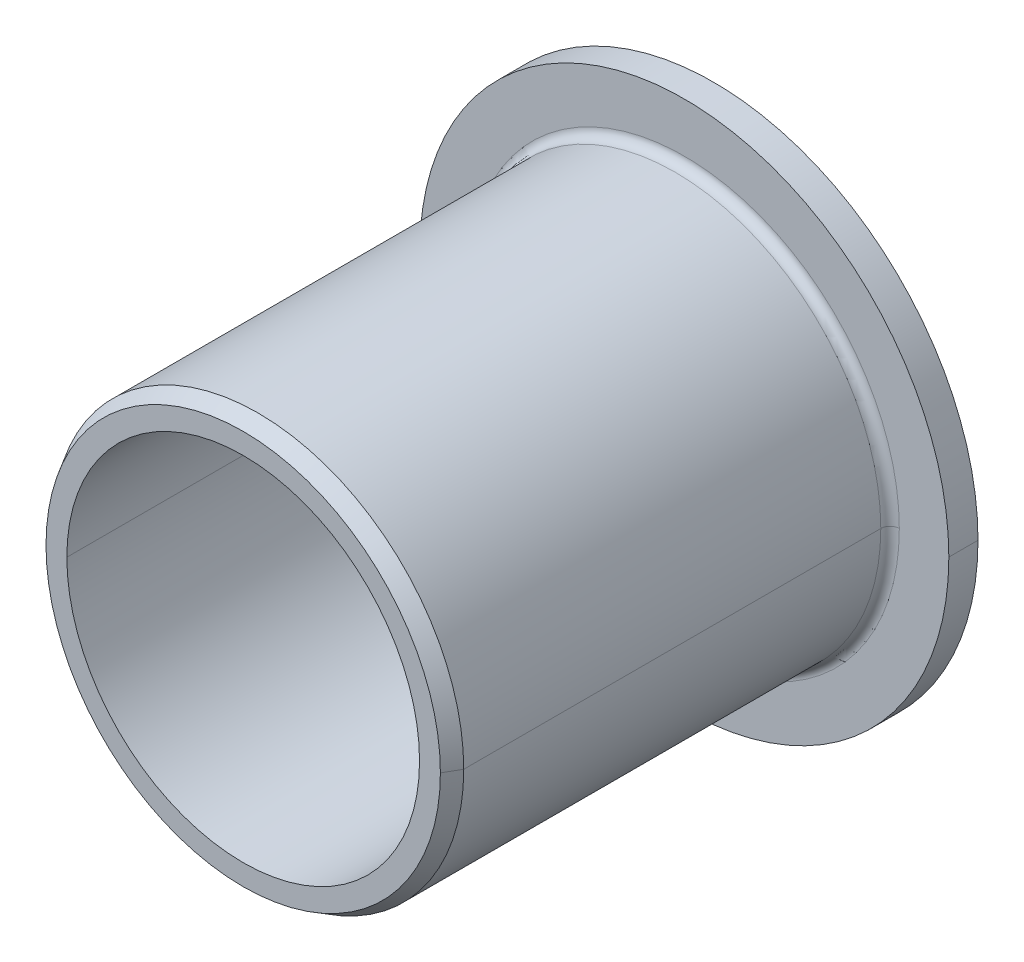
ISO-10303-21;
HEADER;
FILE_DESCRIPTION(('STEP AP214'),'2;1');
FILE_NAME('part.step','',(''),(''),'','','');
FILE_SCHEMA(('AUTOMOTIVE_DESIGN { 1 0 10303 214 1 1 1 1 }'));
ENDSEC;
DATA;
#1=APPLICATION_CONTEXT('core data for automotive mechanical design processes');
#2=APPLICATION_PROTOCOL_DEFINITION('international standard','automotive_design',2000,#1);
#3=PRODUCT_CONTEXT('',#1,'mechanical');
#4=PRODUCT('Part','Part','',(#3));
#5=PRODUCT_RELATED_PRODUCT_CATEGORY('part','',(#4));
#6=PRODUCT_DEFINITION_FORMATION('','',#4);
#7=PRODUCT_DEFINITION_CONTEXT('part definition',#1,'design');
#8=PRODUCT_DEFINITION('design','',#6,#7);
#9=PRODUCT_DEFINITION_SHAPE('','',#8);
#10=(LENGTH_UNIT() NAMED_UNIT(*) SI_UNIT(.MILLI.,.METRE.));
#11=(NAMED_UNIT(*) PLANE_ANGLE_UNIT() SI_UNIT($,.RADIAN.));
#12=(NAMED_UNIT(*) SI_UNIT($,.STERADIAN.) SOLID_ANGLE_UNIT());
#13=UNCERTAINTY_MEASURE_WITH_UNIT(LENGTH_MEASURE(1.E-05),#10,'distance_accuracy_value','');
#14=(GEOMETRIC_REPRESENTATION_CONTEXT(3) GLOBAL_UNCERTAINTY_ASSIGNED_CONTEXT((#13)) GLOBAL_UNIT_ASSIGNED_CONTEXT((#10,
#11,#12)) REPRESENTATION_CONTEXT('',''));
#15=CARTESIAN_POINT('',(0.,0.,0.));
#16=DIRECTION('',(0.,0.,1.));
#17=DIRECTION('',(1.,0.,0.));
#18=AXIS2_PLACEMENT_3D('',#15,#16,#17);
#19=CARTESIAN_POINT('',(11.90625,0.,0.));
#20=DIRECTION('',(0.,0.,-1.));
#21=DIRECTION('',(0.,-1.,0.));
#22=AXIS2_PLACEMENT_3D('',#19,#20,#21);
#23=PLANE('',#22);
#24=CARTESIAN_POINT('',(0.,0.,0.));
#25=DIRECTION('',(0.,0.,1.));
#26=DIRECTION('',(1.,0.,0.));
#27=AXIS2_PLACEMENT_3D('',#24,#25,#26);
#28=CIRCLE('',#27,9.525);
#29=CARTESIAN_POINT('',(9.525,0.,0.));
#30=VERTEX_POINT('',#29);
#31=CARTESIAN_POINT('',(-9.525,0.,0.));
#32=VERTEX_POINT('',#31);
#33=EDGE_CURVE('E11',#30,#32,#28,.T.);
#34=ORIENTED_EDGE('',*,*,#33,.T.);
#35=CARTESIAN_POINT('',(0.,0.,0.));
#36=DIRECTION('',(0.,0.,1.));
#37=DIRECTION('',(1.,0.,0.));
#38=AXIS2_PLACEMENT_3D('',#35,#36,#37);
#39=CIRCLE('',#38,9.525);
#40=EDGE_CURVE('E140',#32,#30,#39,.T.);
#41=ORIENTED_EDGE('',*,*,#40,.T.);
#42=EDGE_LOOP('',(#34,#41));
#43=FACE_BOUND('',#42,.T.);
#44=CARTESIAN_POINT('',(0.,0.,0.));
#45=DIRECTION('',(0.,0.,1.));
#46=DIRECTION('',(1.,0.,0.));
#47=AXIS2_PLACEMENT_3D('',#44,#45,#46);
#48=CIRCLE('',#47,14.2875);
#49=CARTESIAN_POINT('',(14.2875,0.,0.));
#50=VERTEX_POINT('',#49);
#51=CARTESIAN_POINT('',(-14.2875,0.,0.));
#52=VERTEX_POINT('',#51);
#53=EDGE_CURVE('E175',#50,#52,#48,.T.);
#54=ORIENTED_EDGE('',*,*,#53,.F.);
#55=CARTESIAN_POINT('',(0.,0.,0.));
#56=DIRECTION('',(0.,0.,1.));
#57=DIRECTION('',(1.,0.,0.));
#58=AXIS2_PLACEMENT_3D('',#55,#56,#57);
#59=CIRCLE('',#58,14.2875);
#60=EDGE_CURVE('E112',#52,#50,#59,.T.);
#61=ORIENTED_EDGE('',*,*,#60,.F.);
#62=EDGE_LOOP('',(#54,#61));
#63=FACE_BOUND('',#62,.T.);
#64=ADVANCED_FACE('F16',(#43,#63),#23,.T.);
#65=CARTESIAN_POINT('',(0.,0.,12.7));
#66=DIRECTION('',(0.,0.,1.));
#67=DIRECTION('',(1.,0.,0.));
#68=AXIS2_PLACEMENT_3D('',#65,#66,#67);
#69=CYLINDRICAL_SURFACE('',#68,9.525);
#70=DIRECTION('',(0.,0.,1.));
#71=VECTOR('',#70,1.);
#72=CARTESIAN_POINT('',(9.525,0.,12.7));
#73=LINE('',#72,#71);
#74=CARTESIAN_POINT('',(9.525,0.,25.4));
#75=VERTEX_POINT('',#74);
#76=EDGE_CURVE('E149',#30,#75,#73,.T.);
#77=ORIENTED_EDGE('',*,*,#76,.T.);
#78=CARTESIAN_POINT('',(0.,0.,25.4));
#79=DIRECTION('',(0.,0.,1.));
#80=DIRECTION('',(1.,0.,0.));
#81=AXIS2_PLACEMENT_3D('',#78,#79,#80);
#82=CIRCLE('',#81,9.525);
#83=CARTESIAN_POINT('',(-9.525,0.,25.4));
#84=VERTEX_POINT('',#83);
#85=EDGE_CURVE('E27',#75,#84,#82,.T.);
#86=ORIENTED_EDGE('',*,*,#85,.T.);
#87=DIRECTION('',(0.,0.,-1.));
#88=VECTOR('',#87,1.);
#89=CARTESIAN_POINT('',(-9.525,0.,12.7));
#90=LINE('',#89,#88);
#91=EDGE_CURVE('E135',#84,#32,#90,.T.);
#92=ORIENTED_EDGE('',*,*,#91,.T.);
#93=ORIENTED_EDGE('',*,*,#33,.F.);
#94=EDGE_LOOP('',(#77,#86,#92,#93));
#95=FACE_BOUND('',#94,.T.);
#96=ADVANCED_FACE('F228',(#95),#69,.F.);
#97=CARTESIAN_POINT('',(10.0878098923,0.,25.4));
#98=DIRECTION('',(0.,0.,1.));
#99=DIRECTION('',(1.,0.,0.));
#100=AXIS2_PLACEMENT_3D('',#97,#98,#99);
#101=PLANE('',#100);
#102=ORIENTED_EDGE('',*,*,#85,.F.);
#103=CARTESIAN_POINT('',(0.,0.,25.4));
#104=DIRECTION('',(0.,0.,1.));
#105=DIRECTION('',(1.,0.,0.));
#106=AXIS2_PLACEMENT_3D('',#103,#104,#105);
#107=CIRCLE('',#106,9.525);
#108=EDGE_CURVE('E131',#84,#75,#107,.T.);
#109=ORIENTED_EDGE('',*,*,#108,.F.);
#110=EDGE_LOOP('',(#102,#109));
#111=FACE_BOUND('',#110,.T.);
#112=CARTESIAN_POINT('',(0.,0.,25.4));
#113=DIRECTION('',(0.,0.,1.));
#114=DIRECTION('',(1.,0.,0.));
#115=AXIS2_PLACEMENT_3D('',#112,#113,#114);
#116=CIRCLE('',#115,10.6506197846);
#117=CARTESIAN_POINT('',(10.6506197846,0.,25.4));
#118=VERTEX_POINT('',#117);
#119=CARTESIAN_POINT('',(-10.6506197846,0.,25.4));
#120=VERTEX_POINT('',#119);
#121=EDGE_CURVE('E143',#118,#120,#116,.T.);
#122=ORIENTED_EDGE('',*,*,#121,.T.);
#123=CARTESIAN_POINT('',(0.,0.,25.4));
#124=DIRECTION('',(0.,0.,1.));
#125=DIRECTION('',(1.,0.,0.));
#126=AXIS2_PLACEMENT_3D('',#123,#124,#125);
#127=CIRCLE('',#126,10.6506197846);
#128=EDGE_CURVE('E185',#120,#118,#127,.T.);
#129=ORIENTED_EDGE('',*,*,#128,.T.);
#130=EDGE_LOOP('',(#122,#129));
#131=FACE_BOUND('',#130,.T.);
#132=ADVANCED_FACE('F234',(#111,#131),#101,.T.);
#133=CARTESIAN_POINT('',(0.,0.,25.));
#134=DIRECTION('',(0.,0.,-1.));
#135=DIRECTION('',(1.,0.,0.));
#136=AXIS2_PLACEMENT_3D('',#133,#134,#135);
#137=CONICAL_SURFACE('',#136,10.8815598923,0.523598775643582);
#138=DIRECTION('',(-0.500000000039216,0.,0.866025403761797));
#139=VECTOR('',#138,1.);
#140=CARTESIAN_POINT('',(10.8815598923,0.,25.));
#141=LINE('',#140,#139);
#142=CARTESIAN_POINT('',(11.1125,0.,24.6));
#143=VERTEX_POINT('',#142);
#144=EDGE_CURVE('E134',#143,#118,#141,.T.);
#145=ORIENTED_EDGE('',*,*,#144,.T.);
#146=ORIENTED_EDGE('',*,*,#128,.F.);
#147=DIRECTION('',(-0.500000000039216,0.,-0.866025403761797));
#148=VECTOR('',#147,1.);
#149=CARTESIAN_POINT('',(-10.8815598923,0.,25.));
#150=LINE('',#149,#148);
#151=CARTESIAN_POINT('',(-11.1125,0.,24.6));
#152=VERTEX_POINT('',#151);
#153=EDGE_CURVE('E148',#120,#152,#150,.T.);
#154=ORIENTED_EDGE('',*,*,#153,.T.);
#155=CARTESIAN_POINT('',(0.,0.,24.6));
#156=DIRECTION('',(0.,0.,1.));
#157=DIRECTION('',(1.,0.,0.));
#158=AXIS2_PLACEMENT_3D('',#155,#156,#157);
#159=CIRCLE('',#158,11.1125);
#160=EDGE_CURVE('E111',#152,#143,#159,.T.);
#161=ORIENTED_EDGE('',*,*,#160,.T.);
#162=EDGE_LOOP('',(#145,#146,#154,#161));
#163=FACE_BOUND('',#162,.T.);
#164=ADVANCED_FACE('F252',(#163),#137,.T.);
#165=CARTESIAN_POINT('',(0.,0.,13.3374));
#166=DIRECTION('',(0.,0.,1.));
#167=DIRECTION('',(1.,0.,0.));
#168=AXIS2_PLACEMENT_3D('',#165,#166,#167);
#169=CYLINDRICAL_SURFACE('',#168,11.1125);
#170=DIRECTION('',(0.,0.,1.));
#171=VECTOR('',#170,1.);
#172=CARTESIAN_POINT('',(11.1125,0.,13.3374));
#173=LINE('',#172,#171);
#174=CARTESIAN_POINT('',(11.1125,0.,2.0748));
#175=VERTEX_POINT('',#174);
#176=EDGE_CURVE('E147',#175,#143,#173,.T.);
#177=ORIENTED_EDGE('',*,*,#176,.T.);
#178=ORIENTED_EDGE('',*,*,#160,.F.);
#179=DIRECTION('',(0.,0.,-1.));
#180=VECTOR('',#179,1.);
#181=CARTESIAN_POINT('',(-11.1125,0.,13.3374));
#182=LINE('',#181,#180);
#183=CARTESIAN_POINT('',(-11.1125,0.,2.0748));
#184=VERTEX_POINT('',#183);
#185=EDGE_CURVE('E120',#152,#184,#182,.T.);
#186=ORIENTED_EDGE('',*,*,#185,.T.);
#187=CARTESIAN_POINT('',(0.,0.,2.0748));
#188=DIRECTION('',(0.,0.,1.));
#189=DIRECTION('',(1.,0.,0.));
#190=AXIS2_PLACEMENT_3D('',#187,#188,#189);
#191=CIRCLE('',#190,11.1125);
#192=EDGE_CURVE('E118',#184,#175,#191,.T.);
#193=ORIENTED_EDGE('',*,*,#192,.T.);
#194=EDGE_LOOP('',(#177,#178,#186,#193));
#195=FACE_BOUND('',#194,.T.);
#196=ADVANCED_FACE('F225',(#195),#169,.T.);
#197=CARTESIAN_POINT('',(0.,0.,2.0748));
#198=DIRECTION('',(0.,0.,1.));
#199=DIRECTION('',(1.,0.,0.));
#200=AXIS2_PLACEMENT_3D('',#197,#198,#199);
#201=TOROIDAL_SURFACE('',#200,11.6125,0.5);
#202=CARTESIAN_POINT('',(-11.6125,0.,2.0748));
#203=DIRECTION('',(0.,-1.,0.));
#204=DIRECTION('',(-1.,0.,0.));
#205=AXIS2_PLACEMENT_3D('',#202,#203,#204);
#206=CIRCLE('',#205,0.5);
#207=CARTESIAN_POINT('',(-11.6125,0.,1.5748));
#208=VERTEX_POINT('',#207);
#209=EDGE_CURVE('E104',#208,#184,#206,.T.);
#210=ORIENTED_EDGE('',*,*,#209,.T.);
#211=CARTESIAN_POINT('',(0.,0.,2.0748));
#212=DIRECTION('',(0.,0.,1.));
#213=DIRECTION('',(1.,0.,0.));
#214=AXIS2_PLACEMENT_3D('',#211,#212,#213);
#215=CIRCLE('',#214,11.1125);
#216=EDGE_CURVE('E126',#175,#184,#215,.T.);
#217=ORIENTED_EDGE('',*,*,#216,.F.);
#218=CARTESIAN_POINT('',(11.6125,0.,2.0748));
#219=DIRECTION('',(0.,-1.,0.));
#220=DIRECTION('',(1.,0.,0.));
#221=AXIS2_PLACEMENT_3D('',#218,#219,#220);
#222=CIRCLE('',#221,0.5);
#223=CARTESIAN_POINT('',(11.6125,0.,1.5748));
#224=VERTEX_POINT('',#223);
#225=EDGE_CURVE('E107',#175,#224,#222,.T.);
#226=ORIENTED_EDGE('',*,*,#225,.T.);
#227=CARTESIAN_POINT('',(0.,0.,1.5748));
#228=DIRECTION('',(0.,0.,1.));
#229=DIRECTION('',(1.,0.,0.));
#230=AXIS2_PLACEMENT_3D('',#227,#228,#229);
#231=CIRCLE('',#230,11.6125);
#232=EDGE_CURVE('E99',#224,#208,#231,.T.);
#233=ORIENTED_EDGE('',*,*,#232,.T.);
#234=EDGE_LOOP('',(#210,#217,#226,#233));
#235=FACE_BOUND('',#234,.T.);
#236=ADVANCED_FACE('F101',(#235),#201,.F.);
#237=CARTESIAN_POINT('',(12.95,0.,1.5748));
#238=DIRECTION('',(0.,0.,1.));
#239=DIRECTION('',(1.,0.,0.));
#240=AXIS2_PLACEMENT_3D('',#237,#238,#239);
#241=PLANE('',#240);
#242=ORIENTED_EDGE('',*,*,#232,.F.);
#243=CARTESIAN_POINT('',(0.,0.,1.5748));
#244=DIRECTION('',(0.,0.,1.));
#245=DIRECTION('',(1.,0.,0.));
#246=AXIS2_PLACEMENT_3D('',#243,#244,#245);
#247=CIRCLE('',#246,11.6125);
#248=EDGE_CURVE('E20',#208,#224,#247,.T.);
#249=ORIENTED_EDGE('',*,*,#248,.F.);
#250=EDGE_LOOP('',(#242,#249));
#251=FACE_BOUND('',#250,.T.);
#252=CARTESIAN_POINT('',(0.,0.,1.5748));
#253=DIRECTION('',(0.,0.,1.));
#254=DIRECTION('',(1.,0.,0.));
#255=AXIS2_PLACEMENT_3D('',#252,#253,#254);
#256=CIRCLE('',#255,14.2875);
#257=CARTESIAN_POINT('',(14.2875,0.,1.5748));
#258=VERTEX_POINT('',#257);
#259=CARTESIAN_POINT('',(-14.2875,0.,1.5748));
#260=VERTEX_POINT('',#259);
#261=EDGE_CURVE('E183',#258,#260,#256,.T.);
#262=ORIENTED_EDGE('',*,*,#261,.T.);
#263=CARTESIAN_POINT('',(0.,0.,1.5748));
#264=DIRECTION('',(0.,0.,1.));
#265=DIRECTION('',(1.,0.,0.));
#266=AXIS2_PLACEMENT_3D('',#263,#264,#265);
#267=CIRCLE('',#266,14.2875);
#268=EDGE_CURVE('E40',#260,#258,#267,.T.);
#269=ORIENTED_EDGE('',*,*,#268,.T.);
#270=EDGE_LOOP('',(#262,#269));
#271=FACE_BOUND('',#270,.T.);
#272=ADVANCED_FACE('F18',(#251,#271),#241,.T.);
#273=CARTESIAN_POINT('',(0.,0.,0.7874));
#274=DIRECTION('',(0.,0.,1.));
#275=DIRECTION('',(1.,0.,0.));
#276=AXIS2_PLACEMENT_3D('',#273,#274,#275);
#277=CYLINDRICAL_SURFACE('',#276,14.2875);
#278=DIRECTION('',(0.,0.,1.));
#279=VECTOR('',#278,1.);
#280=CARTESIAN_POINT('',(14.2875,0.,0.7874));
#281=LINE('',#280,#279);
#282=EDGE_CURVE('E180',#50,#258,#281,.T.);
#283=ORIENTED_EDGE('',*,*,#282,.T.);
#284=ORIENTED_EDGE('',*,*,#268,.F.);
#285=DIRECTION('',(0.,0.,-1.));
#286=VECTOR('',#285,1.);
#287=CARTESIAN_POINT('',(-14.2875,0.,0.7874));
#288=LINE('',#287,#286);
#289=EDGE_CURVE('E179',#260,#52,#288,.T.);
#290=ORIENTED_EDGE('',*,*,#289,.T.);
#291=ORIENTED_EDGE('',*,*,#60,.T.);
#292=EDGE_LOOP('',(#283,#284,#290,#291));
#293=FACE_BOUND('',#292,.T.);
#294=ADVANCED_FACE('F212',(#293),#277,.T.);
#295=CARTESIAN_POINT('',(0.,0.,0.7874));
#296=DIRECTION('',(0.,0.,1.));
#297=DIRECTION('',(1.,0.,0.));
#298=AXIS2_PLACEMENT_3D('',#295,#296,#297);
#299=CYLINDRICAL_SURFACE('',#298,14.2875);
#300=ORIENTED_EDGE('',*,*,#282,.F.);
#301=ORIENTED_EDGE('',*,*,#53,.T.);
#302=ORIENTED_EDGE('',*,*,#289,.F.);
#303=ORIENTED_EDGE('',*,*,#261,.F.);
#304=EDGE_LOOP('',(#300,#301,#302,#303));
#305=FACE_BOUND('',#304,.T.);
#306=ADVANCED_FACE('F216',(#305),#299,.T.);
#307=CARTESIAN_POINT('',(0.,0.,2.0748));
#308=DIRECTION('',(0.,0.,1.));
#309=DIRECTION('',(1.,0.,0.));
#310=AXIS2_PLACEMENT_3D('',#307,#308,#309);
#311=TOROIDAL_SURFACE('',#310,11.6125,0.5);
#312=ORIENTED_EDGE('',*,*,#209,.F.);
#313=ORIENTED_EDGE('',*,*,#248,.T.);
#314=ORIENTED_EDGE('',*,*,#225,.F.);
#315=ORIENTED_EDGE('',*,*,#192,.F.);
#316=EDGE_LOOP('',(#312,#313,#314,#315));
#317=FACE_BOUND('',#316,.T.);
#318=ADVANCED_FACE('F117',(#317),#311,.F.);
#319=CARTESIAN_POINT('',(0.,0.,13.3374));
#320=DIRECTION('',(0.,0.,1.));
#321=DIRECTION('',(1.,0.,0.));
#322=AXIS2_PLACEMENT_3D('',#319,#320,#321);
#323=CYLINDRICAL_SURFACE('',#322,11.1125);
#324=ORIENTED_EDGE('',*,*,#176,.F.);
#325=ORIENTED_EDGE('',*,*,#216,.T.);
#326=ORIENTED_EDGE('',*,*,#185,.F.);
#327=CARTESIAN_POINT('',(0.,0.,24.6));
#328=DIRECTION('',(0.,0.,1.));
#329=DIRECTION('',(1.,0.,0.));
#330=AXIS2_PLACEMENT_3D('',#327,#328,#329);
#331=CIRCLE('',#330,11.1125);
#332=EDGE_CURVE('E156',#143,#152,#331,.T.);
#333=ORIENTED_EDGE('',*,*,#332,.F.);
#334=EDGE_LOOP('',(#324,#325,#326,#333));
#335=FACE_BOUND('',#334,.T.);
#336=ADVANCED_FACE('F238',(#335),#323,.T.);
#337=CARTESIAN_POINT('',(0.,0.,25.));
#338=DIRECTION('',(0.,0.,-1.));
#339=DIRECTION('',(1.,0.,0.));
#340=AXIS2_PLACEMENT_3D('',#337,#338,#339);
#341=CONICAL_SURFACE('',#340,10.8815598923,0.523598775643582);
#342=ORIENTED_EDGE('',*,*,#144,.F.);
#343=ORIENTED_EDGE('',*,*,#332,.T.);
#344=ORIENTED_EDGE('',*,*,#153,.F.);
#345=ORIENTED_EDGE('',*,*,#121,.F.);
#346=EDGE_LOOP('',(#342,#343,#344,#345));
#347=FACE_BOUND('',#346,.T.);
#348=ADVANCED_FACE('F244',(#347),#341,.T.);
#349=CARTESIAN_POINT('',(0.,0.,12.7));
#350=DIRECTION('',(0.,0.,1.));
#351=DIRECTION('',(1.,0.,0.));
#352=AXIS2_PLACEMENT_3D('',#349,#350,#351);
#353=CYLINDRICAL_SURFACE('',#352,9.525);
#354=ORIENTED_EDGE('',*,*,#76,.F.);
#355=ORIENTED_EDGE('',*,*,#40,.F.);
#356=ORIENTED_EDGE('',*,*,#91,.F.);
#357=ORIENTED_EDGE('',*,*,#108,.T.);
#358=EDGE_LOOP('',(#354,#355,#356,#357));
#359=FACE_BOUND('',#358,.T.);
#360=ADVANCED_FACE('F259',(#359),#353,.F.);
#361=CLOSED_SHELL('',(#64,#96,#132,#164,#196,#236,#272,#294,#306,#318,#336,#348,#360));
#362=MANIFOLD_SOLID_BREP('B1',#361);
#363=ADVANCED_BREP_SHAPE_REPRESENTATION('',(#18,#362),#14);
#364=SHAPE_DEFINITION_REPRESENTATION(#9,#363);
ENDSEC;
END-ISO-10303-21;
